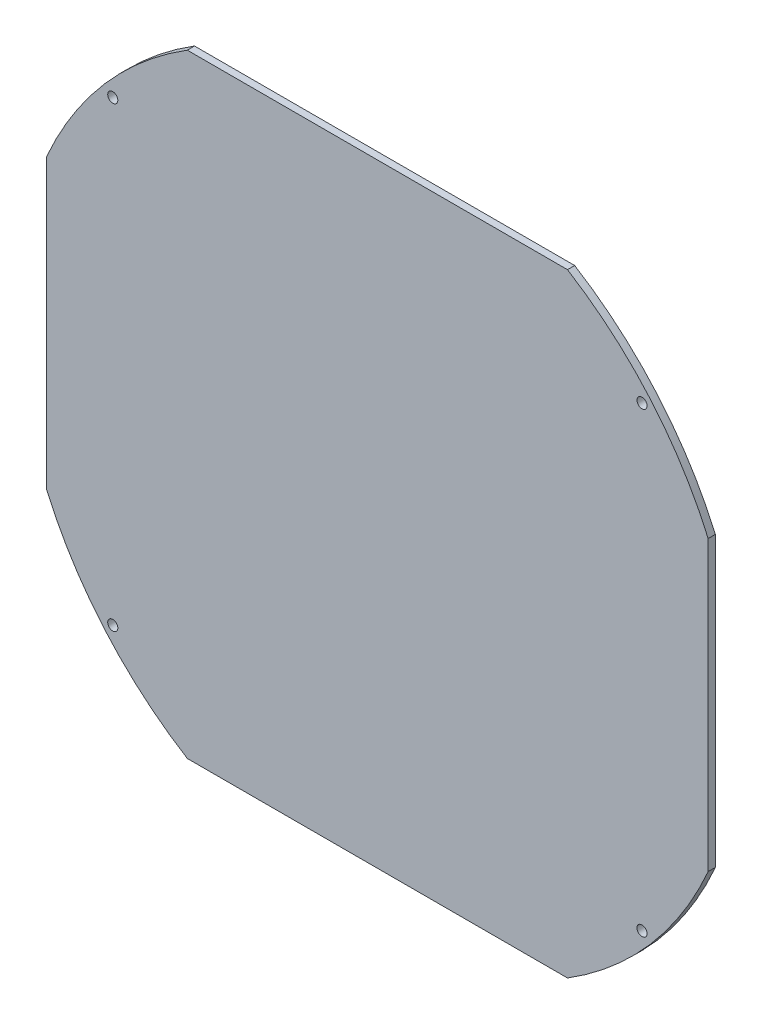
ISO-10303-21;
HEADER;
FILE_DESCRIPTION(('STEP AP214'),'2;1');
FILE_NAME('part.step','',(''),(''),'','','');
FILE_SCHEMA(('AUTOMOTIVE_DESIGN { 1 0 10303 214 1 1 1 1 }'));
ENDSEC;
DATA;
#1=APPLICATION_CONTEXT('core data for automotive mechanical design processes');
#2=APPLICATION_PROTOCOL_DEFINITION('international standard','automotive_design',2000,#1);
#3=PRODUCT_CONTEXT('',#1,'mechanical');
#4=PRODUCT('Part','Part','',(#3));
#5=PRODUCT_RELATED_PRODUCT_CATEGORY('part','',(#4));
#6=PRODUCT_DEFINITION_FORMATION('','',#4);
#7=PRODUCT_DEFINITION_CONTEXT('part definition',#1,'design');
#8=PRODUCT_DEFINITION('design','',#6,#7);
#9=PRODUCT_DEFINITION_SHAPE('','',#8);
#10=(LENGTH_UNIT() NAMED_UNIT(*) SI_UNIT(.MILLI.,.METRE.));
#11=(NAMED_UNIT(*) PLANE_ANGLE_UNIT() SI_UNIT($,.RADIAN.));
#12=(NAMED_UNIT(*) SI_UNIT($,.STERADIAN.) SOLID_ANGLE_UNIT());
#13=UNCERTAINTY_MEASURE_WITH_UNIT(LENGTH_MEASURE(1.E-05),#10,'distance_accuracy_value','');
#14=(GEOMETRIC_REPRESENTATION_CONTEXT(3) GLOBAL_UNCERTAINTY_ASSIGNED_CONTEXT((#13)) GLOBAL_UNIT_ASSIGNED_CONTEXT((#10,
#11,#12)) REPRESENTATION_CONTEXT('',''));
#15=CARTESIAN_POINT('',(0.,0.,0.));
#16=DIRECTION('',(0.,0.,1.));
#17=DIRECTION('',(1.,0.,0.));
#18=AXIS2_PLACEMENT_3D('',#15,#16,#17);
#19=CARTESIAN_POINT('',(0.,0.,3.));
#20=DIRECTION('',(0.,0.,-1.));
#21=DIRECTION('',(-1.,0.,0.));
#22=AXIS2_PLACEMENT_3D('',#19,#20,#21);
#23=CYLINDRICAL_SURFACE('',#22,150.);
#24=CARTESIAN_POINT('',(0.,0.,0.));
#25=DIRECTION('',(0.,0.,1.));
#26=DIRECTION('',(1.,0.,0.));
#27=AXIS2_PLACEMENT_3D('',#24,#25,#26);
#28=CIRCLE('',#27,150.);
#29=CARTESIAN_POINT('',(-79.0174031463957,127.5,0.));
#30=VERTEX_POINT('',#29);
#31=CARTESIAN_POINT('',(-137.5,59.9478940414091,0.));
#32=VERTEX_POINT('',#31);
#33=EDGE_CURVE('E130',#30,#32,#28,.T.);
#34=ORIENTED_EDGE('',*,*,#33,.T.);
#35=DIRECTION('',(0.,0.,-1.));
#36=VECTOR('',#35,1.);
#37=CARTESIAN_POINT('',(-137.5,59.9478940414091,3.));
#38=LINE('',#37,#36);
#39=CARTESIAN_POINT('',(-137.5,59.9478940414091,3.));
#40=VERTEX_POINT('',#39);
#41=EDGE_CURVE('E11',#40,#32,#38,.T.);
#42=ORIENTED_EDGE('',*,*,#41,.F.);
#43=CARTESIAN_POINT('',(0.,0.,3.));
#44=DIRECTION('',(0.,0.,1.));
#45=DIRECTION('',(1.,0.,0.));
#46=AXIS2_PLACEMENT_3D('',#43,#44,#45);
#47=CIRCLE('',#46,150.);
#48=CARTESIAN_POINT('',(-79.0174031463957,127.5,3.));
#49=VERTEX_POINT('',#48);
#50=EDGE_CURVE('E89',#49,#40,#47,.T.);
#51=ORIENTED_EDGE('',*,*,#50,.F.);
#52=DIRECTION('',(0.,0.,-1.));
#53=VECTOR('',#52,1.);
#54=CARTESIAN_POINT('',(-79.0174031463957,127.5,3.));
#55=LINE('',#54,#53);
#56=EDGE_CURVE('E51',#49,#30,#55,.T.);
#57=ORIENTED_EDGE('',*,*,#56,.T.);
#58=EDGE_LOOP('',(#34,#42,#51,#57));
#59=FACE_BOUND('',#58,.T.);
#60=ADVANCED_FACE('F35',(#59),#23,.T.);
#61=CARTESIAN_POINT('',(-137.5,-59.9478940414091,3.));
#62=DIRECTION('',(-1.,0.,0.));
#63=DIRECTION('',(0.,0.,1.));
#64=AXIS2_PLACEMENT_3D('',#61,#62,#63);
#65=PLANE('',#64);
#66=DIRECTION('',(0.,1.,0.));
#67=VECTOR('',#66,1.);
#68=CARTESIAN_POINT('',(-137.5,-59.9478940414091,0.));
#69=LINE('',#68,#67);
#70=CARTESIAN_POINT('',(-137.5,-59.9478940414091,0.));
#71=VERTEX_POINT('',#70);
#72=EDGE_CURVE('E132',#71,#32,#69,.T.);
#73=ORIENTED_EDGE('',*,*,#72,.F.);
#74=DIRECTION('',(0.,0.,-1.));
#75=VECTOR('',#74,1.);
#76=CARTESIAN_POINT('',(-137.5,-59.9478940414091,3.));
#77=LINE('',#76,#75);
#78=CARTESIAN_POINT('',(-137.5,-59.9478940414091,3.));
#79=VERTEX_POINT('',#78);
#80=EDGE_CURVE('E43',#79,#71,#77,.T.);
#81=ORIENTED_EDGE('',*,*,#80,.F.);
#82=DIRECTION('',(0.,1.,0.));
#83=VECTOR('',#82,1.);
#84=CARTESIAN_POINT('',(-137.5,-59.9478940414091,3.));
#85=LINE('',#84,#83);
#86=EDGE_CURVE('E170',#79,#40,#85,.T.);
#87=ORIENTED_EDGE('',*,*,#86,.T.);
#88=ORIENTED_EDGE('',*,*,#41,.T.);
#89=EDGE_LOOP('',(#73,#81,#87,#88));
#90=FACE_BOUND('',#89,.T.);
#91=ADVANCED_FACE('F169',(#90),#65,.T.);
#92=CARTESIAN_POINT('',(0.,0.,3.));
#93=DIRECTION('',(0.,0.,-1.));
#94=DIRECTION('',(-1.,0.,0.));
#95=AXIS2_PLACEMENT_3D('',#92,#93,#94);
#96=CYLINDRICAL_SURFACE('',#95,150.);
#97=CARTESIAN_POINT('',(0.,0.,0.));
#98=DIRECTION('',(0.,0.,1.));
#99=DIRECTION('',(1.,0.,0.));
#100=AXIS2_PLACEMENT_3D('',#97,#98,#99);
#101=CIRCLE('',#100,150.);
#102=CARTESIAN_POINT('',(-79.0174031463957,-127.5,0.));
#103=VERTEX_POINT('',#102);
#104=EDGE_CURVE('E136',#71,#103,#101,.T.);
#105=ORIENTED_EDGE('',*,*,#104,.T.);
#106=DIRECTION('',(0.,0.,-1.));
#107=VECTOR('',#106,1.);
#108=CARTESIAN_POINT('',(-79.0174031463957,-127.5,3.));
#109=LINE('',#108,#107);
#110=CARTESIAN_POINT('',(-79.0174031463957,-127.5,3.));
#111=VERTEX_POINT('',#110);
#112=EDGE_CURVE('E154',#111,#103,#109,.T.);
#113=ORIENTED_EDGE('',*,*,#112,.F.);
#114=CARTESIAN_POINT('',(0.,0.,3.));
#115=DIRECTION('',(0.,0.,1.));
#116=DIRECTION('',(1.,0.,0.));
#117=AXIS2_PLACEMENT_3D('',#114,#115,#116);
#118=CIRCLE('',#117,150.);
#119=EDGE_CURVE('E161',#79,#111,#118,.T.);
#120=ORIENTED_EDGE('',*,*,#119,.F.);
#121=ORIENTED_EDGE('',*,*,#80,.T.);
#122=EDGE_LOOP('',(#105,#113,#120,#121));
#123=FACE_BOUND('',#122,.T.);
#124=ADVANCED_FACE('F159',(#123),#96,.T.);
#125=CARTESIAN_POINT('',(-79.0174031463957,-127.5,3.));
#126=DIRECTION('',(0.,1.,0.));
#127=DIRECTION('',(-1.,0.,0.));
#128=AXIS2_PLACEMENT_3D('',#125,#126,#127);
#129=PLANE('',#128);
#130=DIRECTION('',(1.,0.,0.));
#131=VECTOR('',#130,1.);
#132=CARTESIAN_POINT('',(-79.0174031463957,-127.5,0.));
#133=LINE('',#132,#131);
#134=CARTESIAN_POINT('',(79.0174031463956,-127.5,0.));
#135=VERTEX_POINT('',#134);
#136=EDGE_CURVE('E138',#103,#135,#133,.T.);
#137=ORIENTED_EDGE('',*,*,#136,.T.);
#138=DIRECTION('',(0.,0.,-1.));
#139=VECTOR('',#138,1.);
#140=CARTESIAN_POINT('',(79.0174031463956,-127.5,3.));
#141=LINE('',#140,#139);
#142=CARTESIAN_POINT('',(79.0174031463956,-127.5,3.));
#143=VERTEX_POINT('',#142);
#144=EDGE_CURVE('E151',#143,#135,#141,.T.);
#145=ORIENTED_EDGE('',*,*,#144,.F.);
#146=DIRECTION('',(1.,0.,0.));
#147=VECTOR('',#146,1.);
#148=CARTESIAN_POINT('',(-79.0174031463957,-127.5,3.));
#149=LINE('',#148,#147);
#150=EDGE_CURVE('E296',#111,#143,#149,.T.);
#151=ORIENTED_EDGE('',*,*,#150,.F.);
#152=ORIENTED_EDGE('',*,*,#112,.T.);
#153=EDGE_LOOP('',(#137,#145,#151,#152));
#154=FACE_BOUND('',#153,.T.);
#155=ADVANCED_FACE('F190',(#154),#129,.F.);
#156=CARTESIAN_POINT('',(0.,0.,3.));
#157=DIRECTION('',(0.,0.,-1.));
#158=DIRECTION('',(-1.,0.,0.));
#159=AXIS2_PLACEMENT_3D('',#156,#157,#158);
#160=CYLINDRICAL_SURFACE('',#159,150.);
#161=CARTESIAN_POINT('',(0.,0.,0.));
#162=DIRECTION('',(0.,0.,1.));
#163=DIRECTION('',(1.,0.,0.));
#164=AXIS2_PLACEMENT_3D('',#161,#162,#163);
#165=CIRCLE('',#164,150.);
#166=CARTESIAN_POINT('',(137.5,-59.9478940414091,0.));
#167=VERTEX_POINT('',#166);
#168=EDGE_CURVE('E140',#135,#167,#165,.T.);
#169=ORIENTED_EDGE('',*,*,#168,.T.);
#170=DIRECTION('',(0.,0.,-1.));
#171=VECTOR('',#170,1.);
#172=CARTESIAN_POINT('',(137.5,-59.9478940414091,3.));
#173=LINE('',#172,#171);
#174=CARTESIAN_POINT('',(137.5,-59.9478940414091,3.));
#175=VERTEX_POINT('',#174);
#176=EDGE_CURVE('E122',#175,#167,#173,.T.);
#177=ORIENTED_EDGE('',*,*,#176,.F.);
#178=CARTESIAN_POINT('',(0.,0.,3.));
#179=DIRECTION('',(0.,0.,1.));
#180=DIRECTION('',(1.,0.,0.));
#181=AXIS2_PLACEMENT_3D('',#178,#179,#180);
#182=CIRCLE('',#181,150.);
#183=EDGE_CURVE('E110',#143,#175,#182,.T.);
#184=ORIENTED_EDGE('',*,*,#183,.F.);
#185=ORIENTED_EDGE('',*,*,#144,.T.);
#186=EDGE_LOOP('',(#169,#177,#184,#185));
#187=FACE_BOUND('',#186,.T.);
#188=ADVANCED_FACE('F195',(#187),#160,.T.);
#189=CARTESIAN_POINT('',(137.5,-59.9478940414091,3.));
#190=DIRECTION('',(-1.,0.,0.));
#191=DIRECTION('',(0.,-1.,0.));
#192=AXIS2_PLACEMENT_3D('',#189,#190,#191);
#193=PLANE('',#192);
#194=DIRECTION('',(0.,1.,0.));
#195=VECTOR('',#194,1.);
#196=CARTESIAN_POINT('',(137.5,-59.9478940414091,0.));
#197=LINE('',#196,#195);
#198=CARTESIAN_POINT('',(137.5,59.9478940414092,0.));
#199=VERTEX_POINT('',#198);
#200=EDGE_CURVE('E119',#167,#199,#197,.T.);
#201=ORIENTED_EDGE('',*,*,#200,.T.);
#202=DIRECTION('',(0.,0.,-1.));
#203=VECTOR('',#202,1.);
#204=CARTESIAN_POINT('',(137.5,59.9478940414092,3.));
#205=LINE('',#204,#203);
#206=CARTESIAN_POINT('',(137.5,59.9478940414092,3.));
#207=VERTEX_POINT('',#206);
#208=EDGE_CURVE('E116',#207,#199,#205,.T.);
#209=ORIENTED_EDGE('',*,*,#208,.F.);
#210=DIRECTION('',(0.,1.,0.));
#211=VECTOR('',#210,1.);
#212=CARTESIAN_POINT('',(137.5,-59.9478940414091,3.));
#213=LINE('',#212,#211);
#214=EDGE_CURVE('E104',#175,#207,#213,.T.);
#215=ORIENTED_EDGE('',*,*,#214,.F.);
#216=ORIENTED_EDGE('',*,*,#176,.T.);
#217=EDGE_LOOP('',(#201,#209,#215,#216));
#218=FACE_BOUND('',#217,.T.);
#219=ADVANCED_FACE('F117',(#218),#193,.F.);
#220=CARTESIAN_POINT('',(0.,0.,3.));
#221=DIRECTION('',(0.,0.,-1.));
#222=DIRECTION('',(-1.,0.,0.));
#223=AXIS2_PLACEMENT_3D('',#220,#221,#222);
#224=CYLINDRICAL_SURFACE('',#223,150.);
#225=CARTESIAN_POINT('',(0.,0.,0.));
#226=DIRECTION('',(0.,0.,1.));
#227=DIRECTION('',(1.,0.,0.));
#228=AXIS2_PLACEMENT_3D('',#225,#226,#227);
#229=CIRCLE('',#228,150.);
#230=CARTESIAN_POINT('',(79.0174031463957,127.5,0.));
#231=VERTEX_POINT('',#230);
#232=EDGE_CURVE('E143',#199,#231,#229,.T.);
#233=ORIENTED_EDGE('',*,*,#232,.T.);
#234=DIRECTION('',(0.,0.,-1.));
#235=VECTOR('',#234,1.);
#236=CARTESIAN_POINT('',(79.0174031463957,127.5,3.));
#237=LINE('',#236,#235);
#238=CARTESIAN_POINT('',(79.0174031463957,127.5,3.));
#239=VERTEX_POINT('',#238);
#240=EDGE_CURVE('E77',#239,#231,#237,.T.);
#241=ORIENTED_EDGE('',*,*,#240,.F.);
#242=CARTESIAN_POINT('',(0.,0.,3.));
#243=DIRECTION('',(0.,0.,1.));
#244=DIRECTION('',(1.,0.,0.));
#245=AXIS2_PLACEMENT_3D('',#242,#243,#244);
#246=CIRCLE('',#245,150.);
#247=EDGE_CURVE('E108',#207,#239,#246,.T.);
#248=ORIENTED_EDGE('',*,*,#247,.F.);
#249=ORIENTED_EDGE('',*,*,#208,.T.);
#250=EDGE_LOOP('',(#233,#241,#248,#249));
#251=FACE_BOUND('',#250,.T.);
#252=ADVANCED_FACE('F124',(#251),#224,.T.);
#253=CARTESIAN_POINT('',(-79.0174031463957,127.5,3.));
#254=DIRECTION('',(0.,1.,0.));
#255=DIRECTION('',(-1.,0.,0.));
#256=AXIS2_PLACEMENT_3D('',#253,#254,#255);
#257=PLANE('',#256);
#258=DIRECTION('',(1.,0.,0.));
#259=VECTOR('',#258,1.);
#260=CARTESIAN_POINT('',(-79.0174031463957,127.5,0.));
#261=LINE('',#260,#259);
#262=EDGE_CURVE('E145',#30,#231,#261,.T.);
#263=ORIENTED_EDGE('',*,*,#262,.F.);
#264=ORIENTED_EDGE('',*,*,#56,.F.);
#265=DIRECTION('',(1.,0.,0.));
#266=VECTOR('',#265,1.);
#267=CARTESIAN_POINT('',(-79.0174031463957,127.5,3.));
#268=LINE('',#267,#266);
#269=EDGE_CURVE('E125',#49,#239,#268,.T.);
#270=ORIENTED_EDGE('',*,*,#269,.T.);
#271=ORIENTED_EDGE('',*,*,#240,.T.);
#272=EDGE_LOOP('',(#263,#264,#270,#271));
#273=FACE_BOUND('',#272,.T.);
#274=ADVANCED_FACE('F171',(#273),#257,.T.);
#275=CARTESIAN_POINT('',(0.,0.,3.));
#276=DIRECTION('',(0.,0.,1.));
#277=DIRECTION('',(1.,0.,0.));
#278=AXIS2_PLACEMENT_3D('',#275,#276,#277);
#279=PLANE('',#278);
#280=CARTESIAN_POINT('',(-110.,-95.,3.));
#281=DIRECTION('',(0.,0.,1.));
#282=DIRECTION('',(-1.,0.,0.));
#283=AXIS2_PLACEMENT_3D('',#280,#281,#282);
#284=CIRCLE('',#283,2.1);
#285=CARTESIAN_POINT('',(-112.1,-95.,3.));
#286=VERTEX_POINT('',#285);
#287=EDGE_CURVE('E272',#286,#286,#284,.T.);
#288=ORIENTED_EDGE('',*,*,#287,.F.);
#289=EDGE_LOOP('',(#288));
#290=FACE_BOUND('',#289,.T.);
#291=CARTESIAN_POINT('',(110.,-95.,3.));
#292=DIRECTION('',(0.,0.,1.));
#293=DIRECTION('',(1.,0.,0.));
#294=AXIS2_PLACEMENT_3D('',#291,#292,#293);
#295=CIRCLE('',#294,2.1);
#296=CARTESIAN_POINT('',(112.1,-95.,3.));
#297=VERTEX_POINT('',#296);
#298=EDGE_CURVE('E274',#297,#297,#295,.T.);
#299=ORIENTED_EDGE('',*,*,#298,.F.);
#300=EDGE_LOOP('',(#299));
#301=FACE_BOUND('',#300,.T.);
#302=CARTESIAN_POINT('',(110.,95.,3.));
#303=DIRECTION('',(0.,0.,1.));
#304=DIRECTION('',(-1.,0.,0.));
#305=AXIS2_PLACEMENT_3D('',#302,#303,#304);
#306=CIRCLE('',#305,2.1);
#307=CARTESIAN_POINT('',(107.9,95.,3.));
#308=VERTEX_POINT('',#307);
#309=EDGE_CURVE('E280',#308,#308,#306,.T.);
#310=ORIENTED_EDGE('',*,*,#309,.F.);
#311=EDGE_LOOP('',(#310));
#312=FACE_BOUND('',#311,.T.);
#313=CARTESIAN_POINT('',(-110.,95.,3.));
#314=DIRECTION('',(0.,0.,1.));
#315=DIRECTION('',(1.,0.,0.));
#316=AXIS2_PLACEMENT_3D('',#313,#314,#315);
#317=CIRCLE('',#316,2.1);
#318=CARTESIAN_POINT('',(-107.9,95.,3.));
#319=VERTEX_POINT('',#318);
#320=EDGE_CURVE('E286',#319,#319,#317,.T.);
#321=ORIENTED_EDGE('',*,*,#320,.F.);
#322=EDGE_LOOP('',(#321));
#323=FACE_BOUND('',#322,.T.);
#324=ORIENTED_EDGE('',*,*,#50,.T.);
#325=ORIENTED_EDGE('',*,*,#86,.F.);
#326=ORIENTED_EDGE('',*,*,#119,.T.);
#327=ORIENTED_EDGE('',*,*,#150,.T.);
#328=ORIENTED_EDGE('',*,*,#183,.T.);
#329=ORIENTED_EDGE('',*,*,#214,.T.);
#330=ORIENTED_EDGE('',*,*,#247,.T.);
#331=ORIENTED_EDGE('',*,*,#269,.F.);
#332=EDGE_LOOP('',(#324,#325,#326,#327,#328,#329,#330,#331));
#333=FACE_BOUND('',#332,.T.);
#334=ADVANCED_FACE('F106',(#290,#301,#312,#323,#333),#279,.T.);
#335=CARTESIAN_POINT('',(0.,0.,0.));
#336=DIRECTION('',(0.,0.,1.));
#337=DIRECTION('',(1.,0.,0.));
#338=AXIS2_PLACEMENT_3D('',#335,#336,#337);
#339=PLANE('',#338);
#340=CARTESIAN_POINT('',(-110.,-95.,0.));
#341=DIRECTION('',(0.,0.,1.));
#342=DIRECTION('',(-1.,0.,0.));
#343=AXIS2_PLACEMENT_3D('',#340,#341,#342);
#344=CIRCLE('',#343,2.1);
#345=CARTESIAN_POINT('',(-112.1,-95.,0.));
#346=VERTEX_POINT('',#345);
#347=EDGE_CURVE('E269',#346,#346,#344,.T.);
#348=ORIENTED_EDGE('',*,*,#347,.T.);
#349=EDGE_LOOP('',(#348));
#350=FACE_BOUND('',#349,.T.);
#351=CARTESIAN_POINT('',(110.,-95.,0.));
#352=DIRECTION('',(0.,0.,1.));
#353=DIRECTION('',(1.,0.,0.));
#354=AXIS2_PLACEMENT_3D('',#351,#352,#353);
#355=CIRCLE('',#354,2.1);
#356=CARTESIAN_POINT('',(112.1,-95.,0.));
#357=VERTEX_POINT('',#356);
#358=EDGE_CURVE('E277',#357,#357,#355,.T.);
#359=ORIENTED_EDGE('',*,*,#358,.T.);
#360=EDGE_LOOP('',(#359));
#361=FACE_BOUND('',#360,.T.);
#362=CARTESIAN_POINT('',(110.,95.,0.));
#363=DIRECTION('',(0.,0.,1.));
#364=DIRECTION('',(-1.,0.,0.));
#365=AXIS2_PLACEMENT_3D('',#362,#363,#364);
#366=CIRCLE('',#365,2.1);
#367=CARTESIAN_POINT('',(107.9,95.,0.));
#368=VERTEX_POINT('',#367);
#369=EDGE_CURVE('E283',#368,#368,#366,.T.);
#370=ORIENTED_EDGE('',*,*,#369,.T.);
#371=EDGE_LOOP('',(#370));
#372=FACE_BOUND('',#371,.T.);
#373=CARTESIAN_POINT('',(-110.,95.,0.));
#374=DIRECTION('',(0.,0.,1.));
#375=DIRECTION('',(1.,0.,0.));
#376=AXIS2_PLACEMENT_3D('',#373,#374,#375);
#377=CIRCLE('',#376,2.1);
#378=CARTESIAN_POINT('',(-107.9,95.,0.));
#379=VERTEX_POINT('',#378);
#380=EDGE_CURVE('E133',#379,#379,#377,.T.);
#381=ORIENTED_EDGE('',*,*,#380,.T.);
#382=EDGE_LOOP('',(#381));
#383=FACE_BOUND('',#382,.T.);
#384=ORIENTED_EDGE('',*,*,#33,.F.);
#385=ORIENTED_EDGE('',*,*,#262,.T.);
#386=ORIENTED_EDGE('',*,*,#232,.F.);
#387=ORIENTED_EDGE('',*,*,#200,.F.);
#388=ORIENTED_EDGE('',*,*,#168,.F.);
#389=ORIENTED_EDGE('',*,*,#136,.F.);
#390=ORIENTED_EDGE('',*,*,#104,.F.);
#391=ORIENTED_EDGE('',*,*,#72,.T.);
#392=EDGE_LOOP('',(#384,#385,#386,#387,#388,#389,#390,#391));
#393=FACE_BOUND('',#392,.T.);
#394=ADVANCED_FACE('F167',(#350,#361,#372,#383,#393),#339,.F.);
#395=CARTESIAN_POINT('',(-110.,95.,0.));
#396=DIRECTION('',(0.,0.,1.));
#397=DIRECTION('',(1.,0.,0.));
#398=AXIS2_PLACEMENT_3D('',#395,#396,#397);
#399=CYLINDRICAL_SURFACE('',#398,2.1);
#400=ORIENTED_EDGE('',*,*,#380,.F.);
#401=EDGE_LOOP('',(#400));
#402=FACE_BOUND('',#401,.T.);
#403=ORIENTED_EDGE('',*,*,#320,.T.);
#404=EDGE_LOOP('',(#403));
#405=FACE_BOUND('',#404,.T.);
#406=ADVANCED_FACE('F224',(#402,#405),#399,.F.);
#407=CARTESIAN_POINT('',(110.,95.,0.));
#408=DIRECTION('',(0.,0.,1.));
#409=DIRECTION('',(1.,0.,0.));
#410=AXIS2_PLACEMENT_3D('',#407,#408,#409);
#411=CYLINDRICAL_SURFACE('',#410,2.1);
#412=ORIENTED_EDGE('',*,*,#369,.F.);
#413=EDGE_LOOP('',(#412));
#414=FACE_BOUND('',#413,.T.);
#415=ORIENTED_EDGE('',*,*,#309,.T.);
#416=EDGE_LOOP('',(#415));
#417=FACE_BOUND('',#416,.T.);
#418=ADVANCED_FACE('F232',(#414,#417),#411,.F.);
#419=CARTESIAN_POINT('',(110.,-95.,0.));
#420=DIRECTION('',(0.,0.,1.));
#421=DIRECTION('',(1.,0.,0.));
#422=AXIS2_PLACEMENT_3D('',#419,#420,#421);
#423=CYLINDRICAL_SURFACE('',#422,2.1);
#424=ORIENTED_EDGE('',*,*,#358,.F.);
#425=EDGE_LOOP('',(#424));
#426=FACE_BOUND('',#425,.T.);
#427=ORIENTED_EDGE('',*,*,#298,.T.);
#428=EDGE_LOOP('',(#427));
#429=FACE_BOUND('',#428,.T.);
#430=ADVANCED_FACE('F242',(#426,#429),#423,.F.);
#431=CARTESIAN_POINT('',(-110.,-95.,0.));
#432=DIRECTION('',(0.,0.,1.));
#433=DIRECTION('',(1.,0.,0.));
#434=AXIS2_PLACEMENT_3D('',#431,#432,#433);
#435=CYLINDRICAL_SURFACE('',#434,2.1);
#436=ORIENTED_EDGE('',*,*,#347,.F.);
#437=EDGE_LOOP('',(#436));
#438=FACE_BOUND('',#437,.T.);
#439=ORIENTED_EDGE('',*,*,#287,.T.);
#440=EDGE_LOOP('',(#439));
#441=FACE_BOUND('',#440,.T.);
#442=ADVANCED_FACE('F252',(#438,#441),#435,.F.);
#443=CLOSED_SHELL('',(#60,#91,#124,#155,#188,#219,#252,#274,#334,#394,#406,#418,#430,#442));
#444=MANIFOLD_SOLID_BREP('B2',#443);
#445=ADVANCED_BREP_SHAPE_REPRESENTATION('',(#18,#444),#14);
#446=SHAPE_DEFINITION_REPRESENTATION(#9,#445);
ENDSEC;
END-ISO-10303-21;
